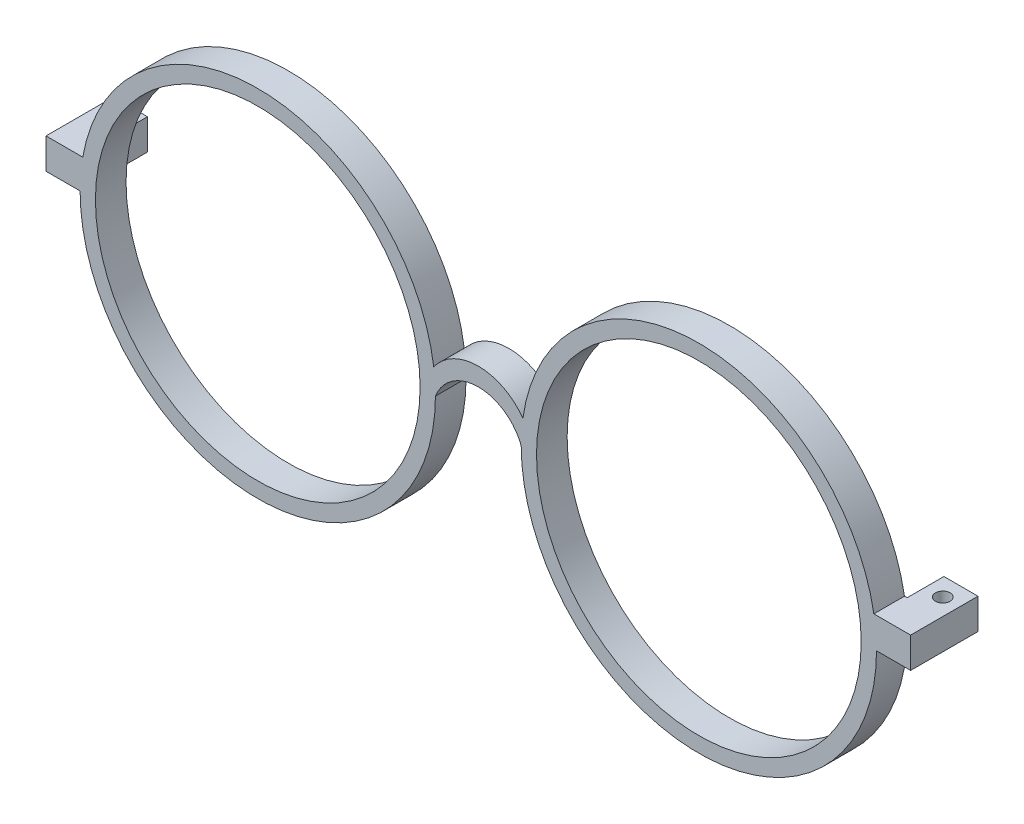
ISO-10303-21;
HEADER;
FILE_DESCRIPTION(('STEP AP214'),'2;1');
FILE_NAME('part.step','',(''),(''),'','','');
FILE_SCHEMA(('AUTOMOTIVE_DESIGN { 1 0 10303 214 1 1 1 1 }'));
ENDSEC;
DATA;
#1=APPLICATION_CONTEXT('core data for automotive mechanical design processes');
#2=APPLICATION_PROTOCOL_DEFINITION('international standard','automotive_design',2000,#1);
#3=PRODUCT_CONTEXT('',#1,'mechanical');
#4=PRODUCT('Part','Part','',(#3));
#5=PRODUCT_RELATED_PRODUCT_CATEGORY('part','',(#4));
#6=PRODUCT_DEFINITION_FORMATION('','',#4);
#7=PRODUCT_DEFINITION_CONTEXT('part definition',#1,'design');
#8=PRODUCT_DEFINITION('design','',#6,#7);
#9=PRODUCT_DEFINITION_SHAPE('','',#8);
#10=(LENGTH_UNIT() NAMED_UNIT(*) SI_UNIT(.MILLI.,.METRE.));
#11=(NAMED_UNIT(*) PLANE_ANGLE_UNIT() SI_UNIT($,.RADIAN.));
#12=(NAMED_UNIT(*) SI_UNIT($,.STERADIAN.) SOLID_ANGLE_UNIT());
#13=UNCERTAINTY_MEASURE_WITH_UNIT(LENGTH_MEASURE(1.E-05),#10,'distance_accuracy_value','');
#14=(GEOMETRIC_REPRESENTATION_CONTEXT(3) GLOBAL_UNCERTAINTY_ASSIGNED_CONTEXT((#13)) GLOBAL_UNIT_ASSIGNED_CONTEXT((#10,
#11,#12)) REPRESENTATION_CONTEXT('',''));
#15=CARTESIAN_POINT('',(0.,0.,0.));
#16=DIRECTION('',(0.,0.,1.));
#17=DIRECTION('',(1.,0.,0.));
#18=AXIS2_PLACEMENT_3D('',#15,#16,#17);
#19=CARTESIAN_POINT('',(0.,0.,0.));
#20=DIRECTION('',(0.,0.,1.));
#21=DIRECTION('',(1.,0.,0.));
#22=AXIS2_PLACEMENT_3D('',#19,#20,#21);
#23=PLANE('',#22);
#24=CARTESIAN_POINT('',(36.,0.,0.));
#25=DIRECTION('',(0.,0.,1.));
#26=DIRECTION('',(1.,0.,0.));
#27=AXIS2_PLACEMENT_3D('',#24,#25,#26);
#28=CIRCLE('',#27,26.5);
#29=CARTESIAN_POINT('',(62.5,0.,0.));
#30=VERTEX_POINT('',#29);
#31=EDGE_CURVE('E220',#30,#30,#28,.T.);
#32=ORIENTED_EDGE('',*,*,#31,.T.);
#33=EDGE_LOOP('',(#32));
#34=FACE_BOUND('',#33,.T.);
#35=CARTESIAN_POINT('',(-36.,0.,0.));
#36=DIRECTION('',(0.,0.,1.));
#37=DIRECTION('',(1.,0.,0.));
#38=AXIS2_PLACEMENT_3D('',#35,#36,#37);
#39=CIRCLE('',#38,26.5);
#40=CARTESIAN_POINT('',(-9.49999999999999,0.,0.));
#41=VERTEX_POINT('',#40);
#42=EDGE_CURVE('E221',#41,#41,#39,.T.);
#43=ORIENTED_EDGE('',*,*,#42,.T.);
#44=EDGE_LOOP('',(#43));
#45=FACE_BOUND('',#44,.T.);
#46=DIRECTION('',(0.,-1.,0.));
#47=VECTOR('',#46,1.);
#48=CARTESIAN_POINT('',(-65.,5.,0.));
#49=LINE('',#48,#47);
#50=CARTESIAN_POINT('',(-65.,5.,0.));
#51=VERTEX_POINT('',#50);
#52=CARTESIAN_POINT('',(-65.,0.,0.));
#53=VERTEX_POINT('',#52);
#54=EDGE_CURVE('E92',#51,#53,#49,.T.);
#55=ORIENTED_EDGE('',*,*,#54,.F.);
#56=DIRECTION('',(1.,0.,0.));
#57=VECTOR('',#56,1.);
#58=CARTESIAN_POINT('',(0.,5.00000000000001,0.));
#59=LINE('',#58,#57);
#60=CARTESIAN_POINT('',(-64.5657137141714,5.,0.));
#61=VERTEX_POINT('',#60);
#62=EDGE_CURVE('E296',#51,#61,#59,.T.);
#63=ORIENTED_EDGE('',*,*,#62,.T.);
#64=CARTESIAN_POINT('',(-36.,0.,0.));
#65=DIRECTION('',(0.,0.,1.));
#66=DIRECTION('',(1.,0.,0.));
#67=AXIS2_PLACEMENT_3D('',#64,#65,#66);
#68=CIRCLE('',#67,29.);
#69=CARTESIAN_POINT('',(-7.27586206896552,3.99047617696261,0.));
#70=VERTEX_POINT('',#69);
#71=EDGE_CURVE('E228',#70,#61,#68,.T.);
#72=ORIENTED_EDGE('',*,*,#71,.F.);
#73=CARTESIAN_POINT('',(0.0040570779278685,-1.19213815460891,0.));
#74=DIRECTION('',(0.,0.,1.));
#75=DIRECTION('',(1.,0.,0.));
#76=AXIS2_PLACEMENT_3D('',#73,#74,#75);
#77=CIRCLE('',#76,8.93625839460315);
#78=CARTESIAN_POINT('',(7.27718676730985,4.,0.));
#79=VERTEX_POINT('',#78);
#80=EDGE_CURVE('E377',#70,#79,#77,.F.);
#81=ORIENTED_EDGE('',*,*,#80,.T.);
#82=CARTESIAN_POINT('',(36.,0.,0.));
#83=DIRECTION('',(0.,0.,1.));
#84=DIRECTION('',(1.,0.,0.));
#85=AXIS2_PLACEMENT_3D('',#82,#83,#84);
#86=CIRCLE('',#85,29.);
#87=CARTESIAN_POINT('',(64.5657137141714,5.,0.));
#88=VERTEX_POINT('',#87);
#89=EDGE_CURVE('E374',#88,#79,#86,.T.);
#90=ORIENTED_EDGE('',*,*,#89,.F.);
#91=DIRECTION('',(-1.,0.,0.));
#92=VECTOR('',#91,1.);
#93=CARTESIAN_POINT('',(0.,4.99999999999999,0.));
#94=LINE('',#93,#92);
#95=CARTESIAN_POINT('',(65.,5.,0.));
#96=VERTEX_POINT('',#95);
#97=EDGE_CURVE('E187',#96,#88,#94,.T.);
#98=ORIENTED_EDGE('',*,*,#97,.F.);
#99=DIRECTION('',(0.,1.,0.));
#100=VECTOR('',#99,1.);
#101=CARTESIAN_POINT('',(65.,5.,0.));
#102=LINE('',#101,#100);
#103=CARTESIAN_POINT('',(65.,0.,0.));
#104=VERTEX_POINT('',#103);
#105=EDGE_CURVE('E237',#104,#96,#102,.T.);
#106=ORIENTED_EDGE('',*,*,#105,.F.);
#107=CARTESIAN_POINT('',(6.99999999999999,0.,0.));
#108=VERTEX_POINT('',#107);
#109=EDGE_CURVE('E361',#108,#104,#86,.T.);
#110=ORIENTED_EDGE('',*,*,#109,.F.);
#111=CARTESIAN_POINT('',(0.,-2.69258240356725,0.));
#112=DIRECTION('',(0.,0.,1.));
#113=DIRECTION('',(1.,0.,0.));
#114=AXIS2_PLACEMENT_3D('',#111,#112,#113);
#115=CIRCLE('',#114,7.49999999999999);
#116=CARTESIAN_POINT('',(-7.,0.,0.));
#117=VERTEX_POINT('',#116);
#118=EDGE_CURVE('E355',#117,#108,#115,.F.);
#119=ORIENTED_EDGE('',*,*,#118,.F.);
#120=EDGE_CURVE('E300',#53,#117,#68,.T.);
#121=ORIENTED_EDGE('',*,*,#120,.F.);
#122=EDGE_LOOP('',(#55,#63,#72,#81,#90,#98,#106,#110,#119,#121));
#123=FACE_BOUND('',#122,.T.);
#124=ADVANCED_FACE('F75',(#34,#45,#123),#23,.F.);
#125=CARTESIAN_POINT('',(0.,0.,5.));
#126=DIRECTION('',(0.,0.,1.));
#127=DIRECTION('',(1.,0.,0.));
#128=AXIS2_PLACEMENT_3D('',#125,#126,#127);
#129=PLANE('',#128);
#130=CARTESIAN_POINT('',(36.,0.,5.));
#131=DIRECTION('',(0.,0.,1.));
#132=DIRECTION('',(1.,0.,0.));
#133=AXIS2_PLACEMENT_3D('',#130,#131,#132);
#134=CIRCLE('',#133,26.5);
#135=CARTESIAN_POINT('',(62.5,0.,5.));
#136=VERTEX_POINT('',#135);
#137=EDGE_CURVE('E198',#136,#136,#134,.T.);
#138=ORIENTED_EDGE('',*,*,#137,.F.);
#139=EDGE_LOOP('',(#138));
#140=FACE_BOUND('',#139,.T.);
#141=CARTESIAN_POINT('',(-36.,0.,5.));
#142=DIRECTION('',(0.,0.,1.));
#143=DIRECTION('',(1.,0.,0.));
#144=AXIS2_PLACEMENT_3D('',#141,#142,#143);
#145=CIRCLE('',#144,29.);
#146=CARTESIAN_POINT('',(-7.27586206896552,3.99047617696261,5.));
#147=VERTEX_POINT('',#146);
#148=CARTESIAN_POINT('',(-64.5657137141714,5.,5.));
#149=VERTEX_POINT('',#148);
#150=EDGE_CURVE('E139',#147,#149,#145,.T.);
#151=ORIENTED_EDGE('',*,*,#150,.T.);
#152=DIRECTION('',(1.,0.,0.));
#153=VECTOR('',#152,1.);
#154=CARTESIAN_POINT('',(0.,5.00000000000001,5.));
#155=LINE('',#154,#153);
#156=CARTESIAN_POINT('',(-70.5657137141714,5.,5.));
#157=VERTEX_POINT('',#156);
#158=EDGE_CURVE('E217',#157,#149,#155,.T.);
#159=ORIENTED_EDGE('',*,*,#158,.F.);
#160=DIRECTION('',(0.,1.,0.));
#161=VECTOR('',#160,1.);
#162=CARTESIAN_POINT('',(-70.5657137141714,0.,5.));
#163=LINE('',#162,#161);
#164=CARTESIAN_POINT('',(-70.5657137141714,0.,5.));
#165=VERTEX_POINT('',#164);
#166=EDGE_CURVE('E214',#165,#157,#163,.T.);
#167=ORIENTED_EDGE('',*,*,#166,.F.);
#168=DIRECTION('',(-1.,0.,0.));
#169=VECTOR('',#168,1.);
#170=CARTESIAN_POINT('',(0.,0.,5.));
#171=LINE('',#170,#169);
#172=CARTESIAN_POINT('',(-65.,0.,5.));
#173=VERTEX_POINT('',#172);
#174=EDGE_CURVE('E209',#173,#165,#171,.T.);
#175=ORIENTED_EDGE('',*,*,#174,.F.);
#176=CARTESIAN_POINT('',(-7.,0.,5.));
#177=VERTEX_POINT('',#176);
#178=EDGE_CURVE('E206',#173,#177,#145,.T.);
#179=ORIENTED_EDGE('',*,*,#178,.T.);
#180=CARTESIAN_POINT('',(0.,-2.69258240356725,5.));
#181=DIRECTION('',(0.,0.,1.));
#182=DIRECTION('',(1.,0.,0.));
#183=AXIS2_PLACEMENT_3D('',#180,#181,#182);
#184=CIRCLE('',#183,7.49999999999999);
#185=CARTESIAN_POINT('',(6.99999999999999,0.,5.));
#186=VERTEX_POINT('',#185);
#187=EDGE_CURVE('E203',#177,#186,#184,.F.);
#188=ORIENTED_EDGE('',*,*,#187,.T.);
#189=CARTESIAN_POINT('',(36.,0.,5.));
#190=DIRECTION('',(0.,0.,1.));
#191=DIRECTION('',(1.,0.,0.));
#192=AXIS2_PLACEMENT_3D('',#189,#190,#191);
#193=CIRCLE('',#192,29.);
#194=CARTESIAN_POINT('',(65.,0.,5.));
#195=VERTEX_POINT('',#194);
#196=EDGE_CURVE('E197',#186,#195,#193,.T.);
#197=ORIENTED_EDGE('',*,*,#196,.T.);
#198=DIRECTION('',(1.,0.,0.));
#199=VECTOR('',#198,1.);
#200=CARTESIAN_POINT('',(0.,0.,5.));
#201=LINE('',#200,#199);
#202=CARTESIAN_POINT('',(70.5657137141714,0.,5.));
#203=VERTEX_POINT('',#202);
#204=EDGE_CURVE('E202',#195,#203,#201,.T.);
#205=ORIENTED_EDGE('',*,*,#204,.T.);
#206=DIRECTION('',(0.,1.,0.));
#207=VECTOR('',#206,1.);
#208=CARTESIAN_POINT('',(70.5657137141714,0.,5.));
#209=LINE('',#208,#207);
#210=CARTESIAN_POINT('',(70.5657137141714,5.,5.));
#211=VERTEX_POINT('',#210);
#212=EDGE_CURVE('E177',#203,#211,#209,.T.);
#213=ORIENTED_EDGE('',*,*,#212,.T.);
#214=DIRECTION('',(-1.,0.,0.));
#215=VECTOR('',#214,1.);
#216=CARTESIAN_POINT('',(0.,4.99999999999999,5.));
#217=LINE('',#216,#215);
#218=CARTESIAN_POINT('',(64.5657137141714,5.,5.));
#219=VERTEX_POINT('',#218);
#220=EDGE_CURVE('E169',#211,#219,#217,.T.);
#221=ORIENTED_EDGE('',*,*,#220,.T.);
#222=CARTESIAN_POINT('',(7.27718676730985,4.,5.));
#223=VERTEX_POINT('',#222);
#224=EDGE_CURVE('E174',#219,#223,#193,.T.);
#225=ORIENTED_EDGE('',*,*,#224,.T.);
#226=CARTESIAN_POINT('',(0.0040570779278685,-1.19213815460891,5.));
#227=DIRECTION('',(0.,0.,1.));
#228=DIRECTION('',(1.,0.,0.));
#229=AXIS2_PLACEMENT_3D('',#226,#227,#228);
#230=CIRCLE('',#229,8.93625839460315);
#231=EDGE_CURVE('E195',#147,#223,#230,.F.);
#232=ORIENTED_EDGE('',*,*,#231,.F.);
#233=EDGE_LOOP('',(#151,#159,#167,#175,#179,#188,#197,#205,#213,#221,#225,#232));
#234=FACE_BOUND('',#233,.T.);
#235=CARTESIAN_POINT('',(-36.,0.,5.));
#236=DIRECTION('',(0.,0.,1.));
#237=DIRECTION('',(1.,0.,0.));
#238=AXIS2_PLACEMENT_3D('',#235,#236,#237);
#239=CIRCLE('',#238,26.5);
#240=CARTESIAN_POINT('',(-9.49999999999999,0.,5.));
#241=VERTEX_POINT('',#240);
#242=EDGE_CURVE('E224',#241,#241,#239,.T.);
#243=ORIENTED_EDGE('',*,*,#242,.F.);
#244=EDGE_LOOP('',(#243));
#245=FACE_BOUND('',#244,.T.);
#246=ADVANCED_FACE('F171',(#140,#234,#245),#129,.T.);
#247=CARTESIAN_POINT('',(-36.,0.,5.));
#248=DIRECTION('',(0.,0.,-1.));
#249=DIRECTION('',(-1.,0.,0.));
#250=AXIS2_PLACEMENT_3D('',#247,#248,#249);
#251=CYLINDRICAL_SURFACE('',#250,29.);
#252=ORIENTED_EDGE('',*,*,#71,.T.);
#253=DIRECTION('',(0.,0.,-1.));
#254=VECTOR('',#253,1.);
#255=CARTESIAN_POINT('',(-64.5657137141714,5.,5.));
#256=LINE('',#255,#254);
#257=EDGE_CURVE('E12',#149,#61,#256,.T.);
#258=ORIENTED_EDGE('',*,*,#257,.F.);
#259=ORIENTED_EDGE('',*,*,#150,.F.);
#260=DIRECTION('',(0.,0.,-1.));
#261=VECTOR('',#260,1.);
#262=CARTESIAN_POINT('',(-7.27586206896552,3.99047617696261,5.));
#263=LINE('',#262,#261);
#264=EDGE_CURVE('E101',#147,#70,#263,.T.);
#265=ORIENTED_EDGE('',*,*,#264,.T.);
#266=EDGE_LOOP('',(#252,#258,#259,#265));
#267=FACE_BOUND('',#266,.T.);
#268=ADVANCED_FACE('F294',(#267),#251,.T.);
#269=CARTESIAN_POINT('',(0.,5.00000000000001,5.));
#270=DIRECTION('',(0.,1.,0.));
#271=DIRECTION('',(-1.,0.,0.));
#272=AXIS2_PLACEMENT_3D('',#269,#270,#271);
#273=PLANE('',#272);
#274=CARTESIAN_POINT('',(-67.8157137141714,5.,-3.));
#275=DIRECTION('',(0.,1.,0.));
#276=DIRECTION('',(0.,0.,1.));
#277=AXIS2_PLACEMENT_3D('',#274,#275,#276);
#278=CIRCLE('',#277,1.19999999999999);
#279=CARTESIAN_POINT('',(-67.8157137141714,5.,-1.80000000000001));
#280=VERTEX_POINT('',#279);
#281=EDGE_CURVE('E285',#280,#280,#278,.T.);
#282=ORIENTED_EDGE('',*,*,#281,.F.);
#283=EDGE_LOOP('',(#282));
#284=FACE_BOUND('',#283,.T.);
#285=ORIENTED_EDGE('',*,*,#62,.F.);
#286=DIRECTION('',(0.,0.,1.));
#287=VECTOR('',#286,1.);
#288=CARTESIAN_POINT('',(-65.,5.,-6.));
#289=LINE('',#288,#287);
#290=CARTESIAN_POINT('',(-65.,5.,-6.));
#291=VERTEX_POINT('',#290);
#292=EDGE_CURVE('E241',#291,#51,#289,.T.);
#293=ORIENTED_EDGE('',*,*,#292,.F.);
#294=DIRECTION('',(1.,0.,0.));
#295=VECTOR('',#294,1.);
#296=CARTESIAN_POINT('',(-70.5657137141714,5.,-6.));
#297=LINE('',#296,#295);
#298=CARTESIAN_POINT('',(-70.5657137141714,5.,-6.));
#299=VERTEX_POINT('',#298);
#300=EDGE_CURVE('E272',#299,#291,#297,.T.);
#301=ORIENTED_EDGE('',*,*,#300,.F.);
#302=DIRECTION('',(0.,0.,-1.));
#303=VECTOR('',#302,1.);
#304=CARTESIAN_POINT('',(-70.5657137141714,5.,5.));
#305=LINE('',#304,#303);
#306=EDGE_CURVE('E84',#157,#299,#305,.T.);
#307=ORIENTED_EDGE('',*,*,#306,.F.);
#308=ORIENTED_EDGE('',*,*,#158,.T.);
#309=ORIENTED_EDGE('',*,*,#257,.T.);
#310=EDGE_LOOP('',(#285,#293,#301,#307,#308,#309));
#311=FACE_BOUND('',#310,.T.);
#312=ADVANCED_FACE('F77',(#284,#311),#273,.T.);
#313=CARTESIAN_POINT('',(-70.5657137141714,0.,5.));
#314=DIRECTION('',(-1.,0.,0.));
#315=DIRECTION('',(0.,0.,1.));
#316=AXIS2_PLACEMENT_3D('',#313,#314,#315);
#317=PLANE('',#316);
#318=ORIENTED_EDGE('',*,*,#306,.T.);
#319=DIRECTION('',(0.,1.,0.));
#320=VECTOR('',#319,1.);
#321=CARTESIAN_POINT('',(-70.5657137141714,5.,-6.));
#322=LINE('',#321,#320);
#323=CARTESIAN_POINT('',(-70.5657137141714,0.,-6.));
#324=VERTEX_POINT('',#323);
#325=EDGE_CURVE('E265',#324,#299,#322,.T.);
#326=ORIENTED_EDGE('',*,*,#325,.F.);
#327=DIRECTION('',(0.,0.,-1.));
#328=VECTOR('',#327,1.);
#329=CARTESIAN_POINT('',(-70.5657137141714,0.,5.));
#330=LINE('',#329,#328);
#331=EDGE_CURVE('E340',#165,#324,#330,.T.);
#332=ORIENTED_EDGE('',*,*,#331,.F.);
#333=ORIENTED_EDGE('',*,*,#166,.T.);
#334=EDGE_LOOP('',(#318,#326,#332,#333));
#335=FACE_BOUND('',#334,.T.);
#336=ADVANCED_FACE('F293',(#335),#317,.T.);
#337=CARTESIAN_POINT('',(0.,0.,5.));
#338=DIRECTION('',(0.,-1.,0.));
#339=DIRECTION('',(1.,0.,0.));
#340=AXIS2_PLACEMENT_3D('',#337,#338,#339);
#341=PLANE('',#340);
#342=CARTESIAN_POINT('',(-67.8157137141714,0.,-3.));
#343=DIRECTION('',(0.,-1.,0.));
#344=DIRECTION('',(1.,0.,0.));
#345=AXIS2_PLACEMENT_3D('',#342,#343,#344);
#346=CIRCLE('',#345,1.19999999999999);
#347=CARTESIAN_POINT('',(-66.6157137141714,0.,-3.));
#348=VERTEX_POINT('',#347);
#349=EDGE_CURVE('E282',#348,#348,#346,.T.);
#350=ORIENTED_EDGE('',*,*,#349,.F.);
#351=EDGE_LOOP('',(#350));
#352=FACE_BOUND('',#351,.T.);
#353=ORIENTED_EDGE('',*,*,#331,.T.);
#354=DIRECTION('',(-1.,0.,0.));
#355=VECTOR('',#354,1.);
#356=CARTESIAN_POINT('',(-70.5657137141714,0.,-6.));
#357=LINE('',#356,#355);
#358=CARTESIAN_POINT('',(-65.,0.,-6.));
#359=VERTEX_POINT('',#358);
#360=EDGE_CURVE('E263',#359,#324,#357,.T.);
#361=ORIENTED_EDGE('',*,*,#360,.F.);
#362=DIRECTION('',(0.,0.,1.));
#363=VECTOR('',#362,1.);
#364=CARTESIAN_POINT('',(-65.,0.,-6.));
#365=LINE('',#364,#363);
#366=EDGE_CURVE('E260',#359,#53,#365,.T.);
#367=ORIENTED_EDGE('',*,*,#366,.T.);
#368=DIRECTION('',(0.,0.,-1.));
#369=VECTOR('',#368,1.);
#370=CARTESIAN_POINT('',(-65.,0.,5.));
#371=LINE('',#370,#369);
#372=EDGE_CURVE('E338',#173,#53,#371,.T.);
#373=ORIENTED_EDGE('',*,*,#372,.F.);
#374=ORIENTED_EDGE('',*,*,#174,.T.);
#375=EDGE_LOOP('',(#353,#361,#367,#373,#374));
#376=FACE_BOUND('',#375,.T.);
#377=ADVANCED_FACE('F347',(#352,#376),#341,.T.);
#378=ORIENTED_EDGE('',*,*,#120,.T.);
#379=DIRECTION('',(0.,0.,-1.));
#380=VECTOR('',#379,1.);
#381=CARTESIAN_POINT('',(-7.,0.,5.));
#382=LINE('',#381,#380);
#383=EDGE_CURVE('E335',#177,#117,#382,.T.);
#384=ORIENTED_EDGE('',*,*,#383,.F.);
#385=ORIENTED_EDGE('',*,*,#178,.F.);
#386=ORIENTED_EDGE('',*,*,#372,.T.);
#387=EDGE_LOOP('',(#378,#384,#385,#386));
#388=FACE_BOUND('',#387,.T.);
#389=ADVANCED_FACE('F351',(#388),#251,.T.);
#390=CARTESIAN_POINT('',(0.,-2.69258240356725,5.));
#391=DIRECTION('',(0.,0.,-1.));
#392=DIRECTION('',(-1.,0.,0.));
#393=AXIS2_PLACEMENT_3D('',#390,#391,#392);
#394=CYLINDRICAL_SURFACE('',#393,7.49999999999999);
#395=ORIENTED_EDGE('',*,*,#118,.T.);
#396=DIRECTION('',(0.,0.,-1.));
#397=VECTOR('',#396,1.);
#398=CARTESIAN_POINT('',(6.99999999999999,0.,5.));
#399=LINE('',#398,#397);
#400=EDGE_CURVE('E332',#186,#108,#399,.T.);
#401=ORIENTED_EDGE('',*,*,#400,.F.);
#402=ORIENTED_EDGE('',*,*,#187,.F.);
#403=ORIENTED_EDGE('',*,*,#383,.T.);
#404=EDGE_LOOP('',(#395,#401,#402,#403));
#405=FACE_BOUND('',#404,.T.);
#406=ADVANCED_FACE('F354',(#405),#394,.F.);
#407=CARTESIAN_POINT('',(36.,0.,5.));
#408=DIRECTION('',(0.,0.,-1.));
#409=DIRECTION('',(-1.,0.,0.));
#410=AXIS2_PLACEMENT_3D('',#407,#408,#409);
#411=CYLINDRICAL_SURFACE('',#410,29.);
#412=ORIENTED_EDGE('',*,*,#109,.T.);
#413=DIRECTION('',(0.,0.,-1.));
#414=VECTOR('',#413,1.);
#415=CARTESIAN_POINT('',(65.,0.,5.));
#416=LINE('',#415,#414);
#417=EDGE_CURVE('E326',#195,#104,#416,.T.);
#418=ORIENTED_EDGE('',*,*,#417,.F.);
#419=ORIENTED_EDGE('',*,*,#196,.F.);
#420=ORIENTED_EDGE('',*,*,#400,.T.);
#421=EDGE_LOOP('',(#412,#418,#419,#420));
#422=FACE_BOUND('',#421,.T.);
#423=ADVANCED_FACE('F359',(#422),#411,.T.);
#424=CARTESIAN_POINT('',(0.,0.,5.));
#425=DIRECTION('',(0.,1.,0.));
#426=DIRECTION('',(0.,0.,1.));
#427=AXIS2_PLACEMENT_3D('',#424,#425,#426);
#428=PLANE('',#427);
#429=CARTESIAN_POINT('',(67.8157137141714,0.,-3.));
#430=DIRECTION('',(0.,1.,0.));
#431=DIRECTION('',(0.,0.,1.));
#432=AXIS2_PLACEMENT_3D('',#429,#430,#431);
#433=CIRCLE('',#432,1.19999999999999);
#434=CARTESIAN_POINT('',(67.8157137141714,0.,-1.80000000000001));
#435=VERTEX_POINT('',#434);
#436=EDGE_CURVE('E266',#435,#435,#433,.T.);
#437=ORIENTED_EDGE('',*,*,#436,.T.);
#438=EDGE_LOOP('',(#437));
#439=FACE_BOUND('',#438,.T.);
#440=ORIENTED_EDGE('',*,*,#417,.T.);
#441=DIRECTION('',(0.,0.,1.));
#442=VECTOR('',#441,1.);
#443=CARTESIAN_POINT('',(65.,0.,-6.));
#444=LINE('',#443,#442);
#445=CARTESIAN_POINT('',(65.,0.,-6.));
#446=VERTEX_POINT('',#445);
#447=EDGE_CURVE('E225',#446,#104,#444,.T.);
#448=ORIENTED_EDGE('',*,*,#447,.F.);
#449=DIRECTION('',(-1.,0.,0.));
#450=VECTOR('',#449,1.);
#451=CARTESIAN_POINT('',(70.5657137141714,0.,-6.));
#452=LINE('',#451,#450);
#453=CARTESIAN_POINT('',(70.5657137141714,0.,-6.));
#454=VERTEX_POINT('',#453);
#455=EDGE_CURVE('E251',#454,#446,#452,.T.);
#456=ORIENTED_EDGE('',*,*,#455,.F.);
#457=DIRECTION('',(0.,0.,-1.));
#458=VECTOR('',#457,1.);
#459=CARTESIAN_POINT('',(70.5657137141714,0.,5.));
#460=LINE('',#459,#458);
#461=EDGE_CURVE('E324',#203,#454,#460,.T.);
#462=ORIENTED_EDGE('',*,*,#461,.F.);
#463=ORIENTED_EDGE('',*,*,#204,.F.);
#464=EDGE_LOOP('',(#440,#448,#456,#462,#463));
#465=FACE_BOUND('',#464,.T.);
#466=ADVANCED_FACE('F365',(#439,#465),#428,.F.);
#467=CARTESIAN_POINT('',(70.5657137141714,0.,5.));
#468=DIRECTION('',(-1.,0.,0.));
#469=DIRECTION('',(0.,0.,1.));
#470=AXIS2_PLACEMENT_3D('',#467,#468,#469);
#471=PLANE('',#470);
#472=ORIENTED_EDGE('',*,*,#461,.T.);
#473=DIRECTION('',(0.,-1.,0.));
#474=VECTOR('',#473,1.);
#475=CARTESIAN_POINT('',(70.5657137141714,5.,-6.));
#476=LINE('',#475,#474);
#477=CARTESIAN_POINT('',(70.5657137141714,5.,-6.));
#478=VERTEX_POINT('',#477);
#479=EDGE_CURVE('E240',#478,#454,#476,.T.);
#480=ORIENTED_EDGE('',*,*,#479,.F.);
#481=DIRECTION('',(0.,0.,-1.));
#482=VECTOR('',#481,1.);
#483=CARTESIAN_POINT('',(70.5657137141714,5.,5.));
#484=LINE('',#483,#482);
#485=EDGE_CURVE('E191',#211,#478,#484,.T.);
#486=ORIENTED_EDGE('',*,*,#485,.F.);
#487=ORIENTED_EDGE('',*,*,#212,.F.);
#488=EDGE_LOOP('',(#472,#480,#486,#487));
#489=FACE_BOUND('',#488,.T.);
#490=ADVANCED_FACE('F367',(#489),#471,.F.);
#491=CARTESIAN_POINT('',(0.,4.99999999999999,5.));
#492=DIRECTION('',(0.,-1.,0.));
#493=DIRECTION('',(1.,0.,0.));
#494=AXIS2_PLACEMENT_3D('',#491,#492,#493);
#495=PLANE('',#494);
#496=CARTESIAN_POINT('',(67.8157137141714,5.00000000000002,-3.));
#497=DIRECTION('',(0.,1.,0.));
#498=DIRECTION('',(0.,0.,1.));
#499=AXIS2_PLACEMENT_3D('',#496,#497,#498);
#500=CIRCLE('',#499,1.19999999999999);
#501=CARTESIAN_POINT('',(67.8157137141714,5.00000000000002,-1.80000000000001));
#502=VERTEX_POINT('',#501);
#503=EDGE_CURVE('E279',#502,#502,#500,.T.);
#504=ORIENTED_EDGE('',*,*,#503,.F.);
#505=EDGE_LOOP('',(#504));
#506=FACE_BOUND('',#505,.T.);
#507=ORIENTED_EDGE('',*,*,#485,.T.);
#508=DIRECTION('',(1.,0.,0.));
#509=VECTOR('',#508,1.);
#510=CARTESIAN_POINT('',(70.5657137141714,5.,-6.));
#511=LINE('',#510,#509);
#512=CARTESIAN_POINT('',(65.,5.,-6.));
#513=VERTEX_POINT('',#512);
#514=EDGE_CURVE('E234',#513,#478,#511,.T.);
#515=ORIENTED_EDGE('',*,*,#514,.F.);
#516=DIRECTION('',(0.,0.,1.));
#517=VECTOR('',#516,1.);
#518=CARTESIAN_POINT('',(65.,5.,-6.));
#519=LINE('',#518,#517);
#520=EDGE_CURVE('E231',#513,#96,#519,.T.);
#521=ORIENTED_EDGE('',*,*,#520,.T.);
#522=ORIENTED_EDGE('',*,*,#97,.T.);
#523=DIRECTION('',(0.,0.,-1.));
#524=VECTOR('',#523,1.);
#525=CARTESIAN_POINT('',(64.5657137141714,5.,5.));
#526=LINE('',#525,#524);
#527=EDGE_CURVE('E183',#219,#88,#526,.T.);
#528=ORIENTED_EDGE('',*,*,#527,.F.);
#529=ORIENTED_EDGE('',*,*,#220,.F.);
#530=EDGE_LOOP('',(#507,#515,#521,#522,#528,#529));
#531=FACE_BOUND('',#530,.T.);
#532=ADVANCED_FACE('F184',(#506,#531),#495,.F.);
#533=ORIENTED_EDGE('',*,*,#89,.T.);
#534=DIRECTION('',(0.,0.,-1.));
#535=VECTOR('',#534,1.);
#536=CARTESIAN_POINT('',(7.27718676730985,4.,5.));
#537=LINE('',#536,#535);
#538=EDGE_CURVE('E192',#223,#79,#537,.T.);
#539=ORIENTED_EDGE('',*,*,#538,.F.);
#540=ORIENTED_EDGE('',*,*,#224,.F.);
#541=ORIENTED_EDGE('',*,*,#527,.T.);
#542=EDGE_LOOP('',(#533,#539,#540,#541));
#543=FACE_BOUND('',#542,.T.);
#544=ADVANCED_FACE('F194',(#543),#411,.T.);
#545=CARTESIAN_POINT('',(0.0040570779278685,-1.19213815460891,5.));
#546=DIRECTION('',(0.,0.,-1.));
#547=DIRECTION('',(-1.,0.,0.));
#548=AXIS2_PLACEMENT_3D('',#545,#546,#547);
#549=CYLINDRICAL_SURFACE('',#548,8.93625839460315);
#550=ORIENTED_EDGE('',*,*,#80,.F.);
#551=ORIENTED_EDGE('',*,*,#264,.F.);
#552=ORIENTED_EDGE('',*,*,#231,.T.);
#553=ORIENTED_EDGE('',*,*,#538,.T.);
#554=EDGE_LOOP('',(#550,#551,#552,#553));
#555=FACE_BOUND('',#554,.T.);
#556=ADVANCED_FACE('F382',(#555),#549,.T.);
#557=CARTESIAN_POINT('',(36.,0.,5.));
#558=DIRECTION('',(0.,0.,-1.));
#559=DIRECTION('',(-1.,0.,0.));
#560=AXIS2_PLACEMENT_3D('',#557,#558,#559);
#561=CYLINDRICAL_SURFACE('',#560,26.5);
#562=ORIENTED_EDGE('',*,*,#137,.T.);
#563=EDGE_LOOP('',(#562));
#564=FACE_BOUND('',#563,.T.);
#565=ORIENTED_EDGE('',*,*,#31,.F.);
#566=EDGE_LOOP('',(#565));
#567=FACE_BOUND('',#566,.T.);
#568=ADVANCED_FACE('F402',(#564,#567),#561,.F.);
#569=CARTESIAN_POINT('',(-36.,0.,5.));
#570=DIRECTION('',(0.,0.,-1.));
#571=DIRECTION('',(-1.,0.,0.));
#572=AXIS2_PLACEMENT_3D('',#569,#570,#571);
#573=CYLINDRICAL_SURFACE('',#572,26.5);
#574=ORIENTED_EDGE('',*,*,#242,.T.);
#575=EDGE_LOOP('',(#574));
#576=FACE_BOUND('',#575,.T.);
#577=ORIENTED_EDGE('',*,*,#42,.F.);
#578=EDGE_LOOP('',(#577));
#579=FACE_BOUND('',#578,.T.);
#580=ADVANCED_FACE('F405',(#576,#579),#573,.F.);
#581=CARTESIAN_POINT('',(65.,5.,-6.));
#582=DIRECTION('',(1.,0.,0.));
#583=DIRECTION('',(0.,0.,-1.));
#584=AXIS2_PLACEMENT_3D('',#581,#582,#583);
#585=PLANE('',#584);
#586=ORIENTED_EDGE('',*,*,#105,.T.);
#587=ORIENTED_EDGE('',*,*,#520,.F.);
#588=DIRECTION('',(0.,1.,0.));
#589=VECTOR('',#588,1.);
#590=CARTESIAN_POINT('',(65.,5.,-6.));
#591=LINE('',#590,#589);
#592=EDGE_CURVE('E246',#446,#513,#591,.T.);
#593=ORIENTED_EDGE('',*,*,#592,.F.);
#594=ORIENTED_EDGE('',*,*,#447,.T.);
#595=EDGE_LOOP('',(#586,#587,#593,#594));
#596=FACE_BOUND('',#595,.T.);
#597=ADVANCED_FACE('F466',(#596),#585,.F.);
#598=CARTESIAN_POINT('',(0.,0.,-6.));
#599=DIRECTION('',(0.,0.,-1.));
#600=DIRECTION('',(-1.,0.,0.));
#601=AXIS2_PLACEMENT_3D('',#598,#599,#600);
#602=PLANE('',#601);
#603=ORIENTED_EDGE('',*,*,#479,.T.);
#604=ORIENTED_EDGE('',*,*,#455,.T.);
#605=ORIENTED_EDGE('',*,*,#592,.T.);
#606=ORIENTED_EDGE('',*,*,#514,.T.);
#607=EDGE_LOOP('',(#603,#604,#605,#606));
#608=FACE_BOUND('',#607,.T.);
#609=ADVANCED_FACE('F472',(#608),#602,.T.);
#610=CARTESIAN_POINT('',(-65.,5.,-6.));
#611=DIRECTION('',(-1.,0.,0.));
#612=DIRECTION('',(0.,0.,1.));
#613=AXIS2_PLACEMENT_3D('',#610,#611,#612);
#614=PLANE('',#613);
#615=ORIENTED_EDGE('',*,*,#54,.T.);
#616=ORIENTED_EDGE('',*,*,#366,.F.);
#617=DIRECTION('',(0.,-1.,0.));
#618=VECTOR('',#617,1.);
#619=CARTESIAN_POINT('',(-65.,5.,-6.));
#620=LINE('',#619,#618);
#621=EDGE_CURVE('E269',#291,#359,#620,.T.);
#622=ORIENTED_EDGE('',*,*,#621,.F.);
#623=ORIENTED_EDGE('',*,*,#292,.T.);
#624=EDGE_LOOP('',(#615,#616,#622,#623));
#625=FACE_BOUND('',#624,.T.);
#626=ADVANCED_FACE('F303',(#625),#614,.F.);
#627=CARTESIAN_POINT('',(0.,0.,-6.));
#628=DIRECTION('',(0.,0.,1.));
#629=DIRECTION('',(1.,0.,0.));
#630=AXIS2_PLACEMENT_3D('',#627,#628,#629);
#631=PLANE('',#630);
#632=ORIENTED_EDGE('',*,*,#325,.T.);
#633=ORIENTED_EDGE('',*,*,#300,.T.);
#634=ORIENTED_EDGE('',*,*,#621,.T.);
#635=ORIENTED_EDGE('',*,*,#360,.T.);
#636=EDGE_LOOP('',(#632,#633,#634,#635));
#637=FACE_BOUND('',#636,.T.);
#638=ADVANCED_FACE('F310',(#637),#631,.F.);
#639=CARTESIAN_POINT('',(67.8157137141714,5.00000000000002,-3.));
#640=DIRECTION('',(0.,1.,0.));
#641=DIRECTION('',(0.,0.,1.));
#642=AXIS2_PLACEMENT_3D('',#639,#640,#641);
#643=CYLINDRICAL_SURFACE('',#642,1.19999999999999);
#644=ORIENTED_EDGE('',*,*,#503,.T.);
#645=EDGE_LOOP('',(#644));
#646=FACE_BOUND('',#645,.T.);
#647=ORIENTED_EDGE('',*,*,#436,.F.);
#648=EDGE_LOOP('',(#647));
#649=FACE_BOUND('',#648,.T.);
#650=ADVANCED_FACE('F491',(#646,#649),#643,.F.);
#651=CARTESIAN_POINT('',(-67.8157137141714,5.,-3.));
#652=DIRECTION('',(0.,1.,0.));
#653=DIRECTION('',(0.,0.,1.));
#654=AXIS2_PLACEMENT_3D('',#651,#652,#653);
#655=CYLINDRICAL_SURFACE('',#654,1.19999999999999);
#656=ORIENTED_EDGE('',*,*,#349,.T.);
#657=EDGE_LOOP('',(#656));
#658=FACE_BOUND('',#657,.T.);
#659=ORIENTED_EDGE('',*,*,#281,.T.);
#660=EDGE_LOOP('',(#659));
#661=FACE_BOUND('',#660,.T.);
#662=ADVANCED_FACE('F289',(#658,#661),#655,.F.);
#663=CLOSED_SHELL('',(#124,#246,#268,#312,#336,#377,#389,#406,#423,#466,#490,#532,#544,#556,
#568,#580,#597,#609,#626,#638,#650,#662));
#664=MANIFOLD_SOLID_BREP('B2',#663);
#665=ADVANCED_BREP_SHAPE_REPRESENTATION('',(#18,#664),#14);
#666=SHAPE_DEFINITION_REPRESENTATION(#9,#665);
ENDSEC;
END-ISO-10303-21;
